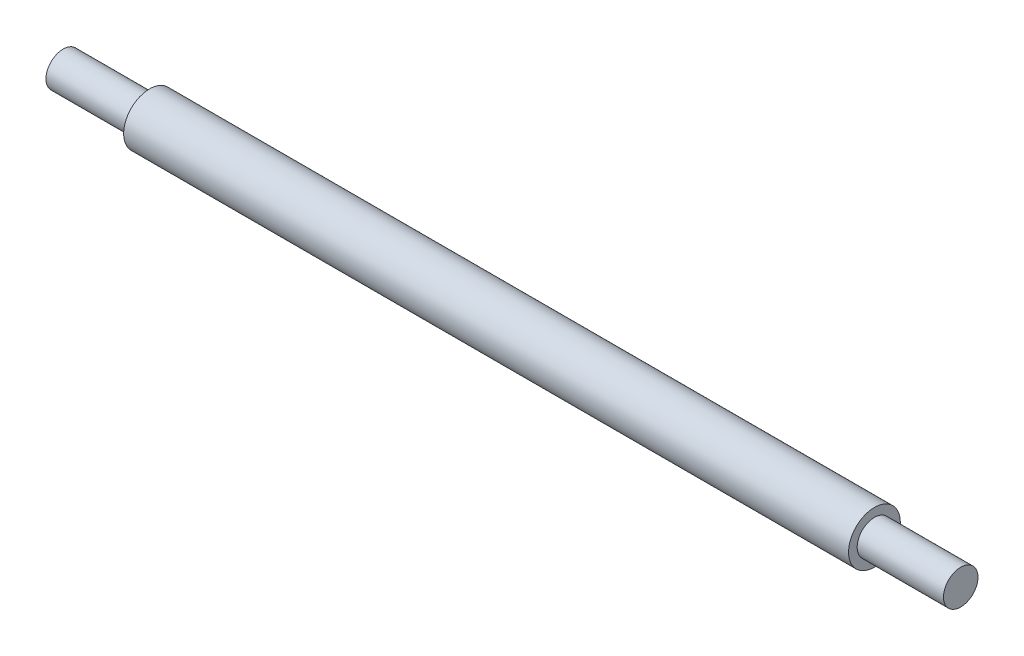
ISO-10303-21;
HEADER;
FILE_DESCRIPTION(('STEP AP214'),'2;1');
FILE_NAME('part.step','',(''),(''),'','','');
FILE_SCHEMA(('AUTOMOTIVE_DESIGN { 1 0 10303 214 1 1 1 1 }'));
ENDSEC;
DATA;
#1=APPLICATION_CONTEXT('core data for automotive mechanical design processes');
#2=APPLICATION_PROTOCOL_DEFINITION('international standard','automotive_design',2000,#1);
#3=PRODUCT_CONTEXT('',#1,'mechanical');
#4=PRODUCT('Part','Part','',(#3));
#5=PRODUCT_RELATED_PRODUCT_CATEGORY('part','',(#4));
#6=PRODUCT_DEFINITION_FORMATION('','',#4);
#7=PRODUCT_DEFINITION_CONTEXT('part definition',#1,'design');
#8=PRODUCT_DEFINITION('design','',#6,#7);
#9=PRODUCT_DEFINITION_SHAPE('','',#8);
#10=(LENGTH_UNIT() NAMED_UNIT(*) SI_UNIT(.MILLI.,.METRE.));
#11=(NAMED_UNIT(*) PLANE_ANGLE_UNIT() SI_UNIT($,.RADIAN.));
#12=(NAMED_UNIT(*) SI_UNIT($,.STERADIAN.) SOLID_ANGLE_UNIT());
#13=UNCERTAINTY_MEASURE_WITH_UNIT(LENGTH_MEASURE(1.E-05),#10,'distance_accuracy_value','');
#14=(GEOMETRIC_REPRESENTATION_CONTEXT(3) GLOBAL_UNCERTAINTY_ASSIGNED_CONTEXT((#13)) GLOBAL_UNIT_ASSIGNED_CONTEXT((#10,
#11,#12)) REPRESENTATION_CONTEXT('',''));
#15=CARTESIAN_POINT('',(0.,0.,0.));
#16=DIRECTION('',(0.,0.,1.));
#17=DIRECTION('',(1.,0.,0.));
#18=AXIS2_PLACEMENT_3D('',#15,#16,#17);
#19=CARTESIAN_POINT('',(0.,0.,0.));
#20=DIRECTION('',(-1.,0.,0.));
#21=DIRECTION('',(0.,0.,1.));
#22=AXIS2_PLACEMENT_3D('',#19,#20,#21);
#23=PLANE('',#22);
#24=CARTESIAN_POINT('',(0.,0.,0.));
#25=DIRECTION('',(1.,0.,0.));
#26=DIRECTION('',(0.,0.,-1.));
#27=AXIS2_PLACEMENT_3D('',#24,#25,#26);
#28=CIRCLE('',#27,2.00000000000001);
#29=CARTESIAN_POINT('',(0.,0.,-2.00000000000001));
#30=VERTEX_POINT('',#29);
#31=EDGE_CURVE('E10',#30,#30,#28,.T.);
#32=ORIENTED_EDGE('',*,*,#31,.F.);
#33=EDGE_LOOP('',(#32));
#34=FACE_BOUND('',#33,.T.);
#35=ADVANCED_FACE('F35',(#34),#23,.T.);
#36=CARTESIAN_POINT('',(0.,0.,0.));
#37=DIRECTION('',(1.,0.,0.));
#38=DIRECTION('',(0.,0.,-1.));
#39=AXIS2_PLACEMENT_3D('',#36,#37,#38);
#40=CYLINDRICAL_SURFACE('',#39,2.00000000000001);
#41=ORIENTED_EDGE('',*,*,#31,.T.);
#42=EDGE_LOOP('',(#41));
#43=FACE_BOUND('',#42,.T.);
#44=CARTESIAN_POINT('',(10.,0.,0.));
#45=DIRECTION('',(1.,0.,0.));
#46=DIRECTION('',(0.,0.,-1.));
#47=AXIS2_PLACEMENT_3D('',#44,#45,#46);
#48=CIRCLE('',#47,2.00000000000001);
#49=CARTESIAN_POINT('',(10.,0.,-2.00000000000001));
#50=VERTEX_POINT('',#49);
#51=EDGE_CURVE('E41',#50,#50,#48,.T.);
#52=ORIENTED_EDGE('',*,*,#51,.F.);
#53=EDGE_LOOP('',(#52));
#54=FACE_BOUND('',#53,.T.);
#55=ADVANCED_FACE('F77',(#43,#54),#40,.T.);
#56=CARTESIAN_POINT('',(10.,2.00000000000001,0.));
#57=DIRECTION('',(-1.,0.,0.));
#58=DIRECTION('',(0.,0.,1.));
#59=AXIS2_PLACEMENT_3D('',#56,#57,#58);
#60=PLANE('',#59);
#61=ORIENTED_EDGE('',*,*,#51,.T.);
#62=EDGE_LOOP('',(#61));
#63=FACE_BOUND('',#62,.T.);
#64=CARTESIAN_POINT('',(10.,0.,0.));
#65=DIRECTION('',(1.,0.,0.));
#66=DIRECTION('',(0.,0.,-1.));
#67=AXIS2_PLACEMENT_3D('',#64,#65,#66);
#68=CIRCLE('',#67,3.);
#69=CARTESIAN_POINT('',(10.,0.,-3.));
#70=VERTEX_POINT('',#69);
#71=EDGE_CURVE('E45',#70,#70,#68,.T.);
#72=ORIENTED_EDGE('',*,*,#71,.F.);
#73=EDGE_LOOP('',(#72));
#74=FACE_BOUND('',#73,.T.);
#75=ADVANCED_FACE('F82',(#63,#74),#60,.T.);
#76=CARTESIAN_POINT('',(0.,0.,0.));
#77=DIRECTION('',(1.,0.,0.));
#78=DIRECTION('',(0.,0.,-1.));
#79=AXIS2_PLACEMENT_3D('',#76,#77,#78);
#80=CYLINDRICAL_SURFACE('',#79,3.);
#81=ORIENTED_EDGE('',*,*,#71,.T.);
#82=EDGE_LOOP('',(#81));
#83=FACE_BOUND('',#82,.T.);
#84=CARTESIAN_POINT('',(94.,0.,0.));
#85=DIRECTION('',(1.,0.,0.));
#86=DIRECTION('',(0.,0.,-1.));
#87=AXIS2_PLACEMENT_3D('',#84,#85,#86);
#88=CIRCLE('',#87,3.);
#89=CARTESIAN_POINT('',(94.,0.,-3.));
#90=VERTEX_POINT('',#89);
#91=EDGE_CURVE('E49',#90,#90,#88,.T.);
#92=ORIENTED_EDGE('',*,*,#91,.F.);
#93=EDGE_LOOP('',(#92));
#94=FACE_BOUND('',#93,.T.);
#95=ADVANCED_FACE('F73',(#83,#94),#80,.T.);
#96=CARTESIAN_POINT('',(94.,3.,0.));
#97=DIRECTION('',(1.,0.,0.));
#98=DIRECTION('',(0.,0.,-1.));
#99=AXIS2_PLACEMENT_3D('',#96,#97,#98);
#100=PLANE('',#99);
#101=ORIENTED_EDGE('',*,*,#91,.T.);
#102=EDGE_LOOP('',(#101));
#103=FACE_BOUND('',#102,.T.);
#104=CARTESIAN_POINT('',(94.,0.,0.));
#105=DIRECTION('',(1.,0.,0.));
#106=DIRECTION('',(0.,0.,-1.));
#107=AXIS2_PLACEMENT_3D('',#104,#105,#106);
#108=CIRCLE('',#107,2.00000000000001);
#109=CARTESIAN_POINT('',(94.,0.,-2.00000000000001));
#110=VERTEX_POINT('',#109);
#111=EDGE_CURVE('E54',#110,#110,#108,.T.);
#112=ORIENTED_EDGE('',*,*,#111,.F.);
#113=EDGE_LOOP('',(#112));
#114=FACE_BOUND('',#113,.T.);
#115=ADVANCED_FACE('F65',(#103,#114),#100,.T.);
#116=CARTESIAN_POINT('',(0.,0.,0.));
#117=DIRECTION('',(1.,0.,0.));
#118=DIRECTION('',(0.,0.,-1.));
#119=AXIS2_PLACEMENT_3D('',#116,#117,#118);
#120=CYLINDRICAL_SURFACE('',#119,2.00000000000001);
#121=ORIENTED_EDGE('',*,*,#111,.T.);
#122=EDGE_LOOP('',(#121));
#123=FACE_BOUND('',#122,.T.);
#124=CARTESIAN_POINT('',(104.,0.,0.));
#125=DIRECTION('',(1.,0.,0.));
#126=DIRECTION('',(0.,0.,-1.));
#127=AXIS2_PLACEMENT_3D('',#124,#125,#126);
#128=CIRCLE('',#127,2.00000000000001);
#129=CARTESIAN_POINT('',(104.,0.,-2.00000000000001));
#130=VERTEX_POINT('',#129);
#131=EDGE_CURVE('E57',#130,#130,#128,.T.);
#132=ORIENTED_EDGE('',*,*,#131,.F.);
#133=EDGE_LOOP('',(#132));
#134=FACE_BOUND('',#133,.T.);
#135=ADVANCED_FACE('F63',(#123,#134),#120,.T.);
#136=CARTESIAN_POINT('',(103.999999999999,2.00000000000001,0.));
#137=DIRECTION('',(1.,0.,0.));
#138=DIRECTION('',(0.,0.,-1.));
#139=AXIS2_PLACEMENT_3D('',#136,#137,#138);
#140=PLANE('',#139);
#141=ORIENTED_EDGE('',*,*,#131,.T.);
#142=EDGE_LOOP('',(#141));
#143=FACE_BOUND('',#142,.T.);
#144=ADVANCED_FACE('F61',(#143),#140,.T.);
#145=CLOSED_SHELL('',(#35,#55,#75,#95,#115,#135,#144));
#146=MANIFOLD_SOLID_BREP('B2',#145);
#147=ADVANCED_BREP_SHAPE_REPRESENTATION('',(#18,#146),#14);
#148=SHAPE_DEFINITION_REPRESENTATION(#9,#147);
ENDSEC;
END-ISO-10303-21;
